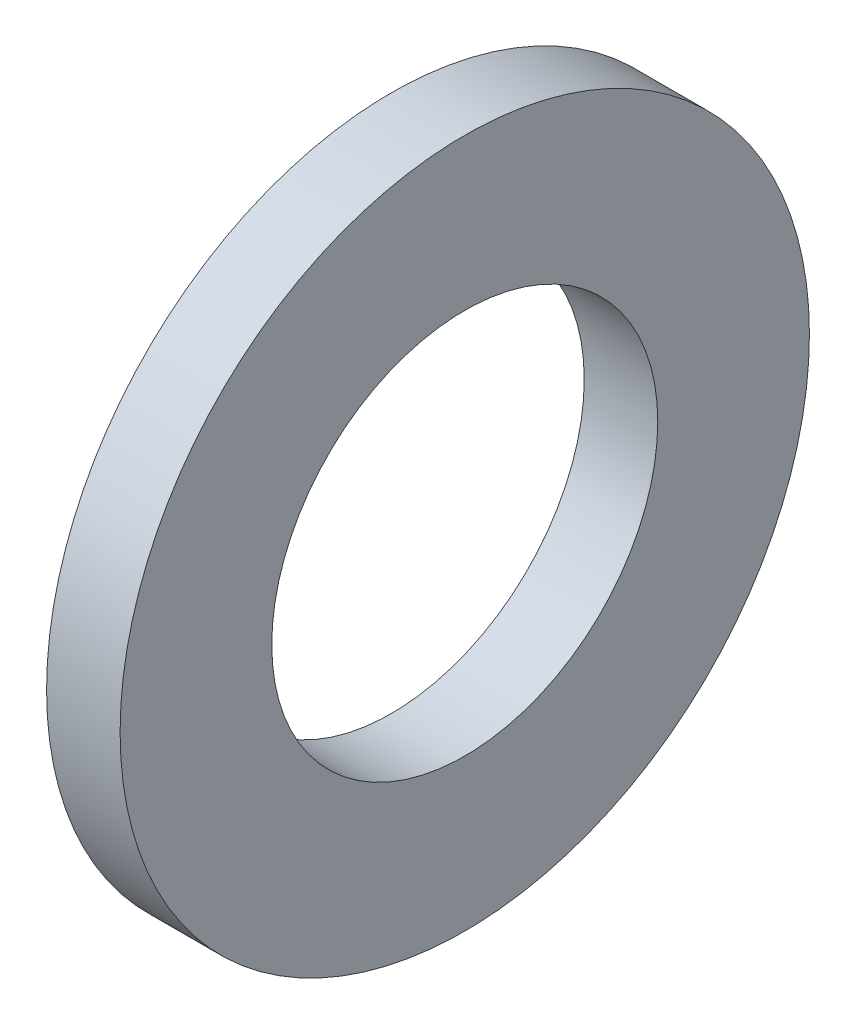
ISO-10303-21;
HEADER;
FILE_DESCRIPTION(('STEP AP214'),'2;1');
FILE_NAME('part.step','',(''),(''),'','','');
FILE_SCHEMA(('AUTOMOTIVE_DESIGN { 1 0 10303 214 1 1 1 1 }'));
ENDSEC;
DATA;
#1=APPLICATION_CONTEXT('core data for automotive mechanical design processes');
#2=APPLICATION_PROTOCOL_DEFINITION('international standard','automotive_design',2000,#1);
#3=PRODUCT_CONTEXT('',#1,'mechanical');
#4=PRODUCT('Part','Part','',(#3));
#5=PRODUCT_RELATED_PRODUCT_CATEGORY('part','',(#4));
#6=PRODUCT_DEFINITION_FORMATION('','',#4);
#7=PRODUCT_DEFINITION_CONTEXT('part definition',#1,'design');
#8=PRODUCT_DEFINITION('design','',#6,#7);
#9=PRODUCT_DEFINITION_SHAPE('','',#8);
#10=(LENGTH_UNIT() NAMED_UNIT(*) SI_UNIT(.MILLI.,.METRE.));
#11=(NAMED_UNIT(*) PLANE_ANGLE_UNIT() SI_UNIT($,.RADIAN.));
#12=(NAMED_UNIT(*) SI_UNIT($,.STERADIAN.) SOLID_ANGLE_UNIT());
#13=UNCERTAINTY_MEASURE_WITH_UNIT(LENGTH_MEASURE(1.E-05),#10,'distance_accuracy_value','');
#14=(GEOMETRIC_REPRESENTATION_CONTEXT(3) GLOBAL_UNCERTAINTY_ASSIGNED_CONTEXT((#13)) GLOBAL_UNIT_ASSIGNED_CONTEXT((#10,
#11,#12)) REPRESENTATION_CONTEXT('',''));
#15=CARTESIAN_POINT('',(0.,0.,0.));
#16=DIRECTION('',(0.,0.,1.));
#17=DIRECTION('',(1.,0.,0.));
#18=AXIS2_PLACEMENT_3D('',#15,#16,#17);
#19=CARTESIAN_POINT('',(-34.9249999999999,0.,0.));
#20=DIRECTION('',(-1.,0.,0.));
#21=DIRECTION('',(0.,0.,1.));
#22=AXIS2_PLACEMENT_3D('',#19,#20,#21);
#23=CYLINDRICAL_SURFACE('',#22,4.2);
#24=CARTESIAN_POINT('',(0.,0.,0.));
#25=DIRECTION('',(-1.,0.,0.));
#26=DIRECTION('',(0.,0.,1.));
#27=AXIS2_PLACEMENT_3D('',#24,#25,#26);
#28=CIRCLE('',#27,4.2);
#29=CARTESIAN_POINT('',(0.,0.,4.2));
#30=VERTEX_POINT('',#29);
#31=EDGE_CURVE('E10',#30,#30,#28,.T.);
#32=ORIENTED_EDGE('',*,*,#31,.F.);
#33=EDGE_LOOP('',(#32));
#34=FACE_BOUND('',#33,.T.);
#35=CARTESIAN_POINT('',(-1.6,0.,0.));
#36=DIRECTION('',(-1.,0.,0.));
#37=DIRECTION('',(0.,0.,1.));
#38=AXIS2_PLACEMENT_3D('',#35,#36,#37);
#39=CIRCLE('',#38,4.2);
#40=CARTESIAN_POINT('',(-1.6,0.,4.2));
#41=VERTEX_POINT('',#40);
#42=EDGE_CURVE('E44',#41,#41,#39,.T.);
#43=ORIENTED_EDGE('',*,*,#42,.T.);
#44=EDGE_LOOP('',(#43));
#45=FACE_BOUND('',#44,.T.);
#46=ADVANCED_FACE('F30',(#34,#45),#23,.F.);
#47=CARTESIAN_POINT('',(0.,4.2,0.));
#48=DIRECTION('',(-1.,0.,0.));
#49=DIRECTION('',(0.,0.,1.));
#50=AXIS2_PLACEMENT_3D('',#47,#48,#49);
#51=PLANE('',#50);
#52=CARTESIAN_POINT('',(0.,0.,0.));
#53=DIRECTION('',(-1.,0.,0.));
#54=DIRECTION('',(0.,0.,1.));
#55=AXIS2_PLACEMENT_3D('',#52,#53,#54);
#56=CIRCLE('',#55,7.5);
#57=CARTESIAN_POINT('',(0.,0.,7.5));
#58=VERTEX_POINT('',#57);
#59=EDGE_CURVE('E36',#58,#58,#56,.T.);
#60=ORIENTED_EDGE('',*,*,#59,.F.);
#61=EDGE_LOOP('',(#60));
#62=FACE_BOUND('',#61,.T.);
#63=ORIENTED_EDGE('',*,*,#31,.T.);
#64=EDGE_LOOP('',(#63));
#65=FACE_BOUND('',#64,.T.);
#66=ADVANCED_FACE('F59',(#62,#65),#51,.F.);
#67=CARTESIAN_POINT('',(-34.9249999999999,0.,0.));
#68=DIRECTION('',(-1.,0.,0.));
#69=DIRECTION('',(0.,0.,1.));
#70=AXIS2_PLACEMENT_3D('',#67,#68,#69);
#71=CYLINDRICAL_SURFACE('',#70,7.5);
#72=CARTESIAN_POINT('',(-1.6,0.,0.));
#73=DIRECTION('',(-1.,0.,0.));
#74=DIRECTION('',(0.,0.,1.));
#75=AXIS2_PLACEMENT_3D('',#72,#73,#74);
#76=CIRCLE('',#75,7.5);
#77=CARTESIAN_POINT('',(-1.6,0.,7.5));
#78=VERTEX_POINT('',#77);
#79=EDGE_CURVE('E40',#78,#78,#76,.T.);
#80=ORIENTED_EDGE('',*,*,#79,.F.);
#81=EDGE_LOOP('',(#80));
#82=FACE_BOUND('',#81,.T.);
#83=ORIENTED_EDGE('',*,*,#59,.T.);
#84=EDGE_LOOP('',(#83));
#85=FACE_BOUND('',#84,.T.);
#86=ADVANCED_FACE('F54',(#82,#85),#71,.T.);
#87=CARTESIAN_POINT('',(-1.6,7.5,0.));
#88=DIRECTION('',(1.,0.,0.));
#89=DIRECTION('',(0.,0.,-1.));
#90=AXIS2_PLACEMENT_3D('',#87,#88,#89);
#91=PLANE('',#90);
#92=ORIENTED_EDGE('',*,*,#42,.F.);
#93=EDGE_LOOP('',(#92));
#94=FACE_BOUND('',#93,.T.);
#95=ORIENTED_EDGE('',*,*,#79,.T.);
#96=EDGE_LOOP('',(#95));
#97=FACE_BOUND('',#96,.T.);
#98=ADVANCED_FACE('F51',(#94,#97),#91,.F.);
#99=CLOSED_SHELL('',(#46,#66,#86,#98));
#100=MANIFOLD_SOLID_BREP('B2',#99);
#101=ADVANCED_BREP_SHAPE_REPRESENTATION('',(#18,#100),#14);
#102=SHAPE_DEFINITION_REPRESENTATION(#9,#101);
ENDSEC;
END-ISO-10303-21;
